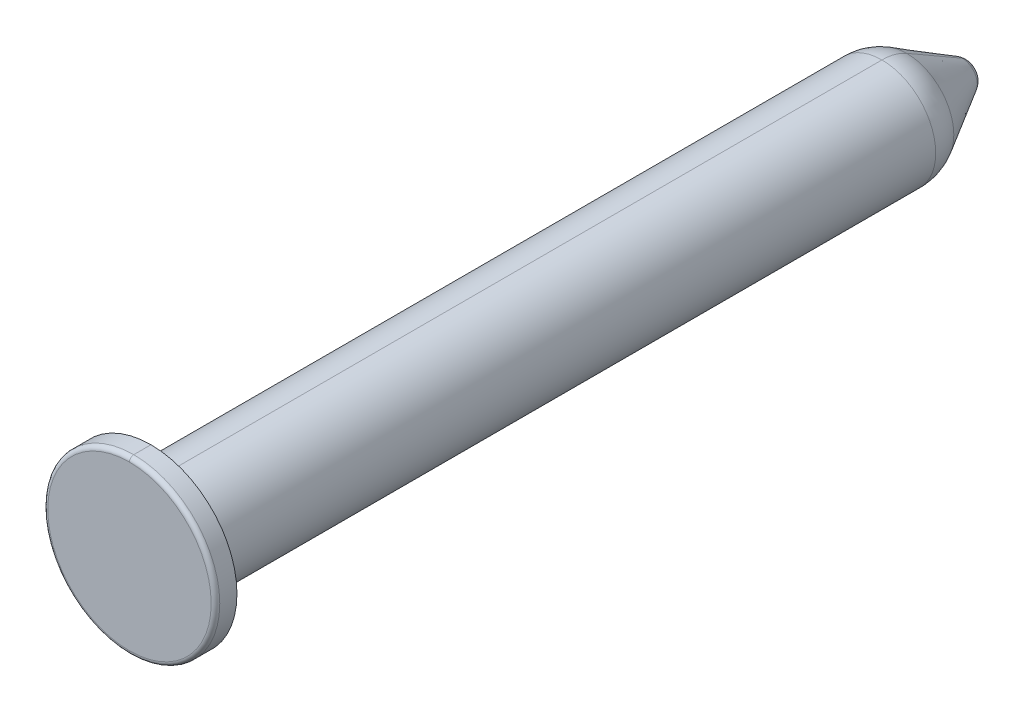
ISO-10303-21;
HEADER;
FILE_DESCRIPTION(('STEP AP214'),'2;1');
FILE_NAME('part.step','',(''),(''),'','','');
FILE_SCHEMA(('AUTOMOTIVE_DESIGN { 1 0 10303 214 1 1 1 1 }'));
ENDSEC;
DATA;
#1=APPLICATION_CONTEXT('core data for automotive mechanical design processes');
#2=APPLICATION_PROTOCOL_DEFINITION('international standard','automotive_design',2000,#1);
#3=PRODUCT_CONTEXT('',#1,'mechanical');
#4=PRODUCT('Part','Part','',(#3));
#5=PRODUCT_RELATED_PRODUCT_CATEGORY('part','',(#4));
#6=PRODUCT_DEFINITION_FORMATION('','',#4);
#7=PRODUCT_DEFINITION_CONTEXT('part definition',#1,'design');
#8=PRODUCT_DEFINITION('design','',#6,#7);
#9=PRODUCT_DEFINITION_SHAPE('','',#8);
#10=(LENGTH_UNIT() NAMED_UNIT(*) SI_UNIT(.MILLI.,.METRE.));
#11=(NAMED_UNIT(*) PLANE_ANGLE_UNIT() SI_UNIT($,.RADIAN.));
#12=(NAMED_UNIT(*) SI_UNIT($,.STERADIAN.) SOLID_ANGLE_UNIT());
#13=UNCERTAINTY_MEASURE_WITH_UNIT(LENGTH_MEASURE(1.E-05),#10,'distance_accuracy_value','');
#14=(GEOMETRIC_REPRESENTATION_CONTEXT(3) GLOBAL_UNCERTAINTY_ASSIGNED_CONTEXT((#13)) GLOBAL_UNIT_ASSIGNED_CONTEXT((#10,
#11,#12)) REPRESENTATION_CONTEXT('',''));
#15=CARTESIAN_POINT('',(0.,0.,0.));
#16=DIRECTION('',(0.,0.,1.));
#17=DIRECTION('',(1.,0.,0.));
#18=AXIS2_PLACEMENT_3D('',#15,#16,#17);
#19=CARTESIAN_POINT('',(0.,0.,-105.4));
#20=DIRECTION('',(0.,0.,-1.));
#21=DIRECTION('',(0.,-1.,0.));
#22=AXIS2_PLACEMENT_3D('',#19,#20,#21);
#23=PLANE('',#22);
#24=CARTESIAN_POINT('',(0.,0.,-105.4));
#25=DIRECTION('',(0.,0.,-1.));
#26=DIRECTION('',(0.,1.,0.));
#27=AXIS2_PLACEMENT_3D('',#24,#25,#26);
#28=CIRCLE('',#27,0.5);
#29=CARTESIAN_POINT('',(0.,0.5,-105.4));
#30=VERTEX_POINT('',#29);
#31=CARTESIAN_POINT('',(0.,-0.5,-105.4));
#32=VERTEX_POINT('',#31);
#33=EDGE_CURVE('E10',#30,#32,#28,.T.);
#34=ORIENTED_EDGE('',*,*,#33,.T.);
#35=CARTESIAN_POINT('',(0.,0.,-105.4));
#36=DIRECTION('',(0.,0.,1.));
#37=DIRECTION('',(0.,1.,0.));
#38=AXIS2_PLACEMENT_3D('',#35,#36,#37);
#39=CIRCLE('',#38,0.5);
#40=EDGE_CURVE('E35',#30,#32,#39,.T.);
#41=ORIENTED_EDGE('',*,*,#40,.F.);
#42=EDGE_LOOP('',(#34,#41));
#43=FACE_BOUND('',#42,.T.);
#44=ADVANCED_FACE('F15',(#43),#23,.T.);
#45=CARTESIAN_POINT('',(0.,0.,-101.933974596215));
#46=DIRECTION('',(0.,0.,-1.));
#47=DIRECTION('',(0.,-1.,0.));
#48=AXIS2_PLACEMENT_3D('',#45,#46,#47);
#49=DEGENERATE_TOROIDAL_SURFACE('',#48,0.5,3.46602540378446,.T.);
#50=CARTESIAN_POINT('',(0.,0.,-103.666987298108));
#51=DIRECTION('',(0.,0.,-1.));
#52=DIRECTION('',(0.,1.,0.));
#53=AXIS2_PLACEMENT_3D('',#50,#51,#52);
#54=CIRCLE('',#53,3.50166604983956);
#55=CARTESIAN_POINT('',(0.,3.50166604983956,-103.666987298108));
#56=VERTEX_POINT('',#55);
#57=CARTESIAN_POINT('',(0.,-3.50166604983956,-103.666987298108));
#58=VERTEX_POINT('',#57);
#59=EDGE_CURVE('E26',#56,#58,#54,.T.);
#60=ORIENTED_EDGE('',*,*,#59,.T.);
#61=CARTESIAN_POINT('',(0.,-0.500000000000006,-101.933974596215));
#62=DIRECTION('',(-1.,0.,0.));
#63=DIRECTION('',(0.,0.,-1.));
#64=AXIS2_PLACEMENT_3D('',#61,#62,#63);
#65=CIRCLE('',#64,3.46602540378444);
#66=EDGE_CURVE('E128',#32,#58,#65,.T.);
#67=ORIENTED_EDGE('',*,*,#66,.F.);
#68=ORIENTED_EDGE('',*,*,#33,.F.);
#69=CARTESIAN_POINT('',(0.,0.500000000000006,-101.933974596215));
#70=DIRECTION('',(1.,0.,0.));
#71=DIRECTION('',(0.,0.,-1.));
#72=AXIS2_PLACEMENT_3D('',#69,#70,#71);
#73=CIRCLE('',#72,3.46602540378444);
#74=EDGE_CURVE('E149',#30,#56,#73,.T.);
#75=ORIENTED_EDGE('',*,*,#74,.T.);
#76=EDGE_LOOP('',(#60,#67,#68,#75));
#77=FACE_BOUND('',#76,.T.);
#78=ADVANCED_FACE('F356',(#77),#49,.T.);
#79=CARTESIAN_POINT('',(0.,0.,-101.933974596215));
#80=DIRECTION('',(0.,0.,-1.));
#81=DIRECTION('',(0.,-1.,0.));
#82=AXIS2_PLACEMENT_3D('',#79,#80,#81);
#83=DEGENERATE_TOROIDAL_SURFACE('',#82,0.5,3.46602540378446,.T.);
#84=ORIENTED_EDGE('',*,*,#40,.T.);
#85=ORIENTED_EDGE('',*,*,#66,.T.);
#86=CARTESIAN_POINT('',(0.,0.,-103.666987298108));
#87=DIRECTION('',(0.,0.,1.));
#88=DIRECTION('',(0.,1.,0.));
#89=AXIS2_PLACEMENT_3D('',#86,#87,#88);
#90=CIRCLE('',#89,3.50166604983956);
#91=EDGE_CURVE('E130',#56,#58,#90,.T.);
#92=ORIENTED_EDGE('',*,*,#91,.F.);
#93=ORIENTED_EDGE('',*,*,#74,.F.);
#94=EDGE_LOOP('',(#84,#85,#92,#93));
#95=FACE_BOUND('',#94,.T.);
#96=ADVANCED_FACE('F345',(#95),#83,.T.);
#97=CARTESIAN_POINT('',(0.,0.,-108.));
#98=DIRECTION('',(0.,0.,1.));
#99=DIRECTION('',(0.,1.,0.));
#100=AXIS2_PLACEMENT_3D('',#97,#98,#99);
#101=CONICAL_SURFACE('',#100,1.,0.523598775598299);
#102=CARTESIAN_POINT('',(0.,0.,-90.75));
#103=DIRECTION('',(0.,0.,-1.));
#104=DIRECTION('',(0.,1.,0.));
#105=AXIS2_PLACEMENT_3D('',#102,#103,#104);
#106=CIRCLE('',#105,10.959292143521);
#107=CARTESIAN_POINT('',(0.,10.959292143521,-90.75));
#108=VERTEX_POINT('',#107);
#109=CARTESIAN_POINT('',(0.,-10.959292143521,-90.75));
#110=VERTEX_POINT('',#109);
#111=EDGE_CURVE('E124',#108,#110,#106,.T.);
#112=ORIENTED_EDGE('',*,*,#111,.T.);
#113=DIRECTION('',(0.,-0.5,0.866025403784439));
#114=VECTOR('',#113,1.);
#115=CARTESIAN_POINT('',(0.,-3.50166604983956,-103.666987298108));
#116=LINE('',#115,#114);
#117=EDGE_CURVE('E133',#58,#110,#116,.T.);
#118=ORIENTED_EDGE('',*,*,#117,.F.);
#119=ORIENTED_EDGE('',*,*,#59,.F.);
#120=DIRECTION('',(0.,0.5,0.866025403784439));
#121=VECTOR('',#120,1.);
#122=CARTESIAN_POINT('',(0.,3.50166604983956,-103.666987298108));
#123=LINE('',#122,#121);
#124=EDGE_CURVE('E129',#56,#108,#123,.T.);
#125=ORIENTED_EDGE('',*,*,#124,.T.);
#126=EDGE_LOOP('',(#112,#118,#119,#125));
#127=FACE_BOUND('',#126,.T.);
#128=ADVANCED_FACE('F333',(#127),#101,.T.);
#129=CARTESIAN_POINT('',(0.,0.,-108.));
#130=DIRECTION('',(0.,0.,1.));
#131=DIRECTION('',(0.,1.,0.));
#132=AXIS2_PLACEMENT_3D('',#129,#130,#131);
#133=CONICAL_SURFACE('',#132,1.,0.523598775598299);
#134=ORIENTED_EDGE('',*,*,#91,.T.);
#135=ORIENTED_EDGE('',*,*,#117,.T.);
#136=CARTESIAN_POINT('',(0.,0.,-90.75));
#137=DIRECTION('',(0.,0.,1.));
#138=DIRECTION('',(0.,1.,0.));
#139=AXIS2_PLACEMENT_3D('',#136,#137,#138);
#140=CIRCLE('',#139,10.959292143521);
#141=EDGE_CURVE('E159',#108,#110,#140,.T.);
#142=ORIENTED_EDGE('',*,*,#141,.F.);
#143=ORIENTED_EDGE('',*,*,#124,.F.);
#144=EDGE_LOOP('',(#134,#135,#142,#143));
#145=FACE_BOUND('',#144,.T.);
#146=ADVANCED_FACE('F321',(#145),#133,.T.);
#147=CARTESIAN_POINT('',(0.,0.,-85.));
#148=DIRECTION('',(0.,0.,-1.));
#149=DIRECTION('',(0.,-1.,0.));
#150=AXIS2_PLACEMENT_3D('',#147,#148,#149);
#151=DEGENERATE_TOROIDAL_SURFACE('',#150,1.,11.5,.T.);
#152=CARTESIAN_POINT('',(0.,0.,-85.));
#153=DIRECTION('',(0.,0.,-1.));
#154=DIRECTION('',(0.,1.,0.));
#155=AXIS2_PLACEMENT_3D('',#152,#153,#154);
#156=CIRCLE('',#155,12.5);
#157=CARTESIAN_POINT('',(0.,12.5,-85.));
#158=VERTEX_POINT('',#157);
#159=CARTESIAN_POINT('',(0.,-12.5,-85.));
#160=VERTEX_POINT('',#159);
#161=EDGE_CURVE('E134',#158,#160,#156,.T.);
#162=ORIENTED_EDGE('',*,*,#161,.T.);
#163=CARTESIAN_POINT('',(0.,-1.,-85.));
#164=DIRECTION('',(-1.,0.,0.));
#165=DIRECTION('',(0.,-0.866025403784439,-0.5));
#166=AXIS2_PLACEMENT_3D('',#163,#164,#165);
#167=CIRCLE('',#166,11.5);
#168=EDGE_CURVE('E173',#110,#160,#167,.T.);
#169=ORIENTED_EDGE('',*,*,#168,.F.);
#170=ORIENTED_EDGE('',*,*,#111,.F.);
#171=CARTESIAN_POINT('',(0.,1.,-85.));
#172=DIRECTION('',(1.,0.,0.));
#173=DIRECTION('',(0.,0.866025403784439,-0.5));
#174=AXIS2_PLACEMENT_3D('',#171,#172,#173);
#175=CIRCLE('',#174,11.5);
#176=EDGE_CURVE('E138',#108,#158,#175,.T.);
#177=ORIENTED_EDGE('',*,*,#176,.T.);
#178=EDGE_LOOP('',(#162,#169,#170,#177));
#179=FACE_BOUND('',#178,.T.);
#180=ADVANCED_FACE('F310',(#179),#151,.T.);
#181=CARTESIAN_POINT('',(0.,0.,-85.));
#182=DIRECTION('',(0.,0.,-1.));
#183=DIRECTION('',(0.,-1.,0.));
#184=AXIS2_PLACEMENT_3D('',#181,#182,#183);
#185=DEGENERATE_TOROIDAL_SURFACE('',#184,1.,11.5,.T.);
#186=ORIENTED_EDGE('',*,*,#141,.T.);
#187=ORIENTED_EDGE('',*,*,#168,.T.);
#188=CARTESIAN_POINT('',(0.,0.,-85.));
#189=DIRECTION('',(0.,0.,1.));
#190=DIRECTION('',(0.,1.,0.));
#191=AXIS2_PLACEMENT_3D('',#188,#189,#190);
#192=CIRCLE('',#191,12.5);
#193=EDGE_CURVE('E142',#158,#160,#192,.T.);
#194=ORIENTED_EDGE('',*,*,#193,.F.);
#195=ORIENTED_EDGE('',*,*,#176,.F.);
#196=EDGE_LOOP('',(#186,#187,#194,#195));
#197=FACE_BOUND('',#196,.T.);
#198=ADVANCED_FACE('F298',(#197),#185,.T.);
#199=CARTESIAN_POINT('',(0.,0.,99.77));
#200=DIRECTION('',(0.,0.,1.));
#201=DIRECTION('',(0.,-1.,0.));
#202=AXIS2_PLACEMENT_3D('',#199,#200,#201);
#203=CYLINDRICAL_SURFACE('',#202,12.5);
#204=CARTESIAN_POINT('',(0.,0.,85.));
#205=DIRECTION('',(0.,0.,-1.));
#206=DIRECTION('',(0.,1.,0.));
#207=AXIS2_PLACEMENT_3D('',#204,#205,#206);
#208=CIRCLE('',#207,12.5);
#209=CARTESIAN_POINT('',(0.,12.5,85.));
#210=VERTEX_POINT('',#209);
#211=CARTESIAN_POINT('',(0.,-12.5,85.));
#212=VERTEX_POINT('',#211);
#213=EDGE_CURVE('E144',#210,#212,#208,.T.);
#214=ORIENTED_EDGE('',*,*,#213,.T.);
#215=DIRECTION('',(0.,0.,1.));
#216=VECTOR('',#215,1.);
#217=CARTESIAN_POINT('',(0.,-12.5,-85.));
#218=LINE('',#217,#216);
#219=EDGE_CURVE('E139',#160,#212,#218,.T.);
#220=ORIENTED_EDGE('',*,*,#219,.F.);
#221=ORIENTED_EDGE('',*,*,#161,.F.);
#222=DIRECTION('',(0.,0.,1.));
#223=VECTOR('',#222,1.);
#224=CARTESIAN_POINT('',(0.,12.5,-85.));
#225=LINE('',#224,#223);
#226=EDGE_CURVE('E57',#158,#210,#225,.T.);
#227=ORIENTED_EDGE('',*,*,#226,.T.);
#228=EDGE_LOOP('',(#214,#220,#221,#227));
#229=FACE_BOUND('',#228,.T.);
#230=ADVANCED_FACE('F285',(#229),#203,.T.);
#231=CARTESIAN_POINT('',(0.,0.,99.77));
#232=DIRECTION('',(0.,0.,1.));
#233=DIRECTION('',(0.,-1.,0.));
#234=AXIS2_PLACEMENT_3D('',#231,#232,#233);
#235=CYLINDRICAL_SURFACE('',#234,12.5);
#236=ORIENTED_EDGE('',*,*,#193,.T.);
#237=ORIENTED_EDGE('',*,*,#219,.T.);
#238=CARTESIAN_POINT('',(0.,0.,85.));
#239=DIRECTION('',(0.,0.,1.));
#240=DIRECTION('',(0.,1.,0.));
#241=AXIS2_PLACEMENT_3D('',#238,#239,#240);
#242=CIRCLE('',#241,12.5);
#243=EDGE_CURVE('E118',#210,#212,#242,.T.);
#244=ORIENTED_EDGE('',*,*,#243,.F.);
#245=ORIENTED_EDGE('',*,*,#226,.F.);
#246=EDGE_LOOP('',(#236,#237,#244,#245));
#247=FACE_BOUND('',#246,.T.);
#248=ADVANCED_FACE('F274',(#247),#235,.T.);
#249=CARTESIAN_POINT('',(0.,0.,85.));
#250=DIRECTION('',(0.,0.,-1.));
#251=DIRECTION('',(0.,-1.,0.));
#252=AXIS2_PLACEMENT_3D('',#249,#250,#251);
#253=PLANE('',#252);
#254=CARTESIAN_POINT('',(0.,0.,85.));
#255=DIRECTION('',(0.,0.,-1.));
#256=DIRECTION('',(0.,1.,0.));
#257=AXIS2_PLACEMENT_3D('',#254,#255,#256);
#258=CIRCLE('',#257,20.);
#259=CARTESIAN_POINT('',(0.,20.,85.));
#260=VERTEX_POINT('',#259);
#261=CARTESIAN_POINT('',(0.,-20.,85.));
#262=VERTEX_POINT('',#261);
#263=EDGE_CURVE('E122',#260,#262,#258,.T.);
#264=ORIENTED_EDGE('',*,*,#263,.T.);
#265=CARTESIAN_POINT('',(0.,0.,85.));
#266=DIRECTION('',(0.,0.,1.));
#267=DIRECTION('',(0.,1.,0.));
#268=AXIS2_PLACEMENT_3D('',#265,#266,#267);
#269=CIRCLE('',#268,20.);
#270=EDGE_CURVE('E67',#260,#262,#269,.T.);
#271=ORIENTED_EDGE('',*,*,#270,.F.);
#272=EDGE_LOOP('',(#264,#271));
#273=FACE_BOUND('',#272,.T.);
#274=ORIENTED_EDGE('',*,*,#243,.T.);
#275=ORIENTED_EDGE('',*,*,#213,.F.);
#276=EDGE_LOOP('',(#274,#275));
#277=FACE_BOUND('',#276,.T.);
#278=ADVANCED_FACE('F263',(#273,#277),#253,.T.);
#279=CARTESIAN_POINT('',(0.,0.,99.77));
#280=DIRECTION('',(0.,0.,1.));
#281=DIRECTION('',(0.,-1.,0.));
#282=AXIS2_PLACEMENT_3D('',#279,#280,#281);
#283=CYLINDRICAL_SURFACE('',#282,20.);
#284=DIRECTION('',(0.,0.,1.));
#285=VECTOR('',#284,1.);
#286=CARTESIAN_POINT('',(0.,-20.,85.));
#287=LINE('',#286,#285);
#288=CARTESIAN_POINT('',(-5.34582110940671E-13,-20.,89.));
#289=VERTEX_POINT('',#288);
#290=EDGE_CURVE('E106',#262,#289,#287,.T.);
#291=ORIENTED_EDGE('',*,*,#290,.F.);
#292=ORIENTED_EDGE('',*,*,#263,.F.);
#293=DIRECTION('',(0.,0.,1.));
#294=VECTOR('',#293,1.);
#295=CARTESIAN_POINT('',(0.,20.,85.));
#296=LINE('',#295,#294);
#297=CARTESIAN_POINT('',(5.34481074460332E-13,20.,89.));
#298=VERTEX_POINT('',#297);
#299=EDGE_CURVE('E123',#260,#298,#296,.T.);
#300=ORIENTED_EDGE('',*,*,#299,.T.);
#301=CARTESIAN_POINT('',(0.,0.,89.));
#302=DIRECTION('',(0.,0.,1.));
#303=DIRECTION('',(0.,-1.,0.));
#304=AXIS2_PLACEMENT_3D('',#301,#302,#303);
#305=CIRCLE('',#304,20.);
#306=EDGE_CURVE('E107',#289,#298,#305,.T.);
#307=ORIENTED_EDGE('',*,*,#306,.F.);
#308=EDGE_LOOP('',(#291,#292,#300,#307));
#309=FACE_BOUND('',#308,.T.);
#310=ADVANCED_FACE('F252',(#309),#283,.T.);
#311=CARTESIAN_POINT('',(0.,0.,99.77));
#312=DIRECTION('',(0.,0.,1.));
#313=DIRECTION('',(0.,-1.,0.));
#314=AXIS2_PLACEMENT_3D('',#311,#312,#313);
#315=CYLINDRICAL_SURFACE('',#314,20.);
#316=ORIENTED_EDGE('',*,*,#299,.F.);
#317=ORIENTED_EDGE('',*,*,#270,.T.);
#318=ORIENTED_EDGE('',*,*,#290,.T.);
#319=CARTESIAN_POINT('',(0.,0.,89.));
#320=DIRECTION('',(0.,0.,1.));
#321=DIRECTION('',(0.,1.,0.));
#322=AXIS2_PLACEMENT_3D('',#319,#320,#321);
#323=CIRCLE('',#322,20.);
#324=EDGE_CURVE('E100',#298,#289,#323,.T.);
#325=ORIENTED_EDGE('',*,*,#324,.F.);
#326=EDGE_LOOP('',(#316,#317,#318,#325));
#327=FACE_BOUND('',#326,.T.);
#328=ADVANCED_FACE('F240',(#327),#315,.T.);
#329=CARTESIAN_POINT('',(0.,0.,89.));
#330=DIRECTION('',(0.,0.,-1.));
#331=DIRECTION('',(-0.0235735974128944,-0.999722104139453,0.));
#332=AXIS2_PLACEMENT_3D('',#329,#330,#331);
#333=TOROIDAL_SURFACE('',#332,19.,1.);
#334=CARTESIAN_POINT('',(1.16382373886673E-11,-19.,89.));
#335=DIRECTION('',(1.,-1.37667686580366E-11,1.16434554368828E-11));
#336=DIRECTION('',(-1.16434554368829E-11,0.,1.));
#337=AXIS2_PLACEMENT_3D('',#334,#335,#336);
#338=CIRCLE('',#337,1.00000000000001);
#339=CARTESIAN_POINT('',(0.,-19.,90.));
#340=VERTEX_POINT('',#339);
#341=EDGE_CURVE('E93',#340,#289,#338,.T.);
#342=ORIENTED_EDGE('',*,*,#341,.T.);
#343=ORIENTED_EDGE('',*,*,#306,.T.);
#344=CARTESIAN_POINT('',(-1.16533828390247E-11,19.,89.));
#345=DIRECTION('',(-1.,1.37839592560707E-11,1.16472766123888E-11));
#346=DIRECTION('',(1.16472766123891E-11,0.,1.));
#347=AXIS2_PLACEMENT_3D('',#344,#345,#346);
#348=CIRCLE('',#347,1.00000000000001);
#349=CARTESIAN_POINT('',(0.,19.,90.));
#350=VERTEX_POINT('',#349);
#351=EDGE_CURVE('E95',#350,#298,#348,.T.);
#352=ORIENTED_EDGE('',*,*,#351,.F.);
#353=CARTESIAN_POINT('',(0.,0.,90.));
#354=DIRECTION('',(0.,0.,1.));
#355=DIRECTION('',(0.,-1.,0.));
#356=AXIS2_PLACEMENT_3D('',#353,#354,#355);
#357=CIRCLE('',#356,19.);
#358=EDGE_CURVE('E19',#340,#350,#357,.T.);
#359=ORIENTED_EDGE('',*,*,#358,.F.);
#360=EDGE_LOOP('',(#342,#343,#352,#359));
#361=FACE_BOUND('',#360,.T.);
#362=ADVANCED_FACE('F91',(#361),#333,.T.);
#363=CARTESIAN_POINT('',(0.,0.,89.));
#364=DIRECTION('',(0.,0.,-1.));
#365=DIRECTION('',(0.0235735974128948,0.999722104139453,0.));
#366=AXIS2_PLACEMENT_3D('',#363,#364,#365);
#367=TOROIDAL_SURFACE('',#366,19.,1.);
#368=ORIENTED_EDGE('',*,*,#351,.T.);
#369=ORIENTED_EDGE('',*,*,#324,.T.);
#370=ORIENTED_EDGE('',*,*,#341,.F.);
#371=CARTESIAN_POINT('',(0.,0.,90.));
#372=DIRECTION('',(0.,0.,1.));
#373=DIRECTION('',(0.,1.,0.));
#374=AXIS2_PLACEMENT_3D('',#371,#372,#373);
#375=CIRCLE('',#374,19.);
#376=EDGE_CURVE('E101',#350,#340,#375,.T.);
#377=ORIENTED_EDGE('',*,*,#376,.F.);
#378=EDGE_LOOP('',(#368,#369,#370,#377));
#379=FACE_BOUND('',#378,.T.);
#380=ADVANCED_FACE('F17',(#379),#367,.T.);
#381=CARTESIAN_POINT('',(0.,0.,90.));
#382=DIRECTION('',(0.,0.,-1.));
#383=DIRECTION('',(0.,-1.,0.));
#384=AXIS2_PLACEMENT_3D('',#381,#382,#383);
#385=PLANE('',#384);
#386=ORIENTED_EDGE('',*,*,#358,.T.);
#387=ORIENTED_EDGE('',*,*,#376,.T.);
#388=EDGE_LOOP('',(#386,#387));
#389=FACE_BOUND('',#388,.T.);
#390=ADVANCED_FACE('F109',(#389),#385,.F.);
#391=CLOSED_SHELL('',(#44,#78,#96,#128,#146,#180,#198,#230,#248,#278,#310,#328,#362,#380,#390));
#392=MANIFOLD_SOLID_BREP('B1',#391);
#393=ADVANCED_BREP_SHAPE_REPRESENTATION('',(#18,#392),#14);
#394=SHAPE_DEFINITION_REPRESENTATION(#9,#393);
ENDSEC;
END-ISO-10303-21;
